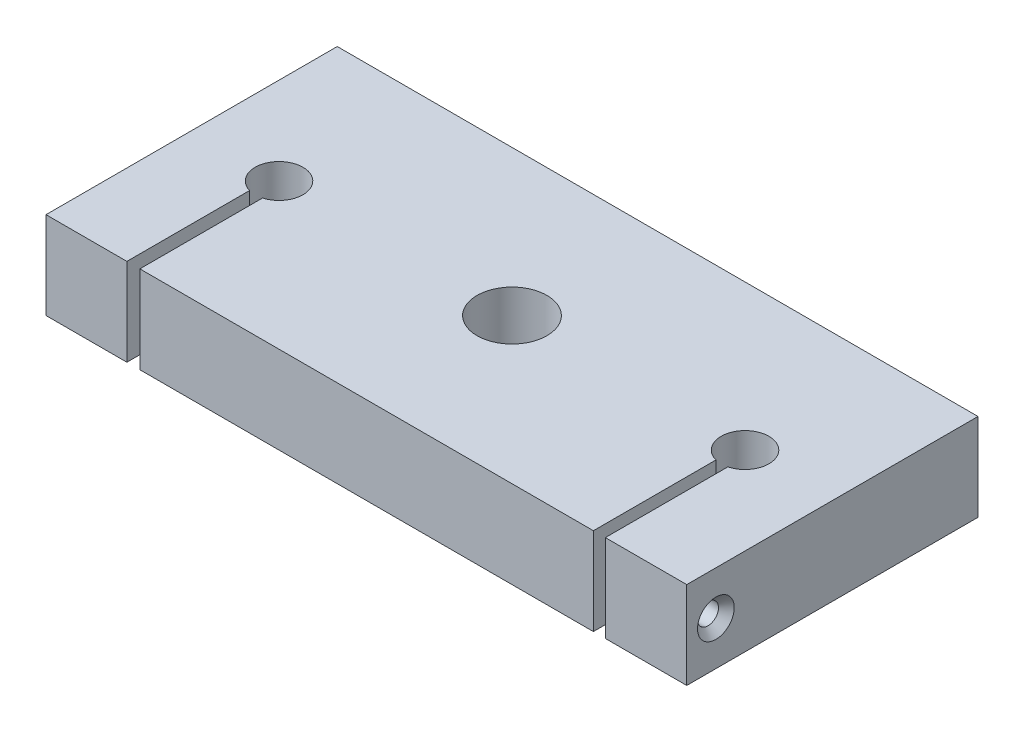
ISO-10303-21;
HEADER;
FILE_DESCRIPTION(('STEP AP214'),'2;1');
FILE_NAME('part.step','',(''),(''),'','','');
FILE_SCHEMA(('AUTOMOTIVE_DESIGN { 1 0 10303 214 1 1 1 1 }'));
ENDSEC;
DATA;
#1=APPLICATION_CONTEXT('core data for automotive mechanical design processes');
#2=APPLICATION_PROTOCOL_DEFINITION('international standard','automotive_design',2000,#1);
#3=PRODUCT_CONTEXT('',#1,'mechanical');
#4=PRODUCT('Part','Part','',(#3));
#5=PRODUCT_RELATED_PRODUCT_CATEGORY('part','',(#4));
#6=PRODUCT_DEFINITION_FORMATION('','',#4);
#7=PRODUCT_DEFINITION_CONTEXT('part definition',#1,'design');
#8=PRODUCT_DEFINITION('design','',#6,#7);
#9=PRODUCT_DEFINITION_SHAPE('','',#8);
#10=(LENGTH_UNIT() NAMED_UNIT(*) SI_UNIT(.MILLI.,.METRE.));
#11=(NAMED_UNIT(*) PLANE_ANGLE_UNIT() SI_UNIT($,.RADIAN.));
#12=(NAMED_UNIT(*) SI_UNIT($,.STERADIAN.) SOLID_ANGLE_UNIT());
#13=UNCERTAINTY_MEASURE_WITH_UNIT(LENGTH_MEASURE(1.E-05),#10,'distance_accuracy_value','');
#14=(GEOMETRIC_REPRESENTATION_CONTEXT(3) GLOBAL_UNCERTAINTY_ASSIGNED_CONTEXT((#13)) GLOBAL_UNIT_ASSIGNED_CONTEXT((#10,
#11,#12)) REPRESENTATION_CONTEXT('',''));
#15=CARTESIAN_POINT('',(0.,0.,0.));
#16=DIRECTION('',(0.,0.,1.));
#17=DIRECTION('',(1.,0.,0.));
#18=AXIS2_PLACEMENT_3D('',#15,#16,#17);
#19=CARTESIAN_POINT('',(55.,15.,25.));
#20=DIRECTION('',(0.,0.,-1.));
#21=DIRECTION('',(-1.,0.,0.));
#22=AXIS2_PLACEMENT_3D('',#19,#20,#21);
#23=PLANE('',#22);
#24=DIRECTION('',(1.,0.,0.));
#25=VECTOR('',#24,1.);
#26=CARTESIAN_POINT('',(55.,15.,25.));
#27=LINE('',#26,#25);
#28=CARTESIAN_POINT('',(41.0249999999999,15.,25.));
#29=VERTEX_POINT('',#28);
#30=CARTESIAN_POINT('',(55.,15.,25.));
#31=VERTEX_POINT('',#30);
#32=EDGE_CURVE('E186',#29,#31,#27,.T.);
#33=ORIENTED_EDGE('',*,*,#32,.F.);
#34=DIRECTION('',(0.,-1.,0.));
#35=VECTOR('',#34,1.);
#36=CARTESIAN_POINT('',(41.0249999999999,15.,25.));
#37=LINE('',#36,#35);
#38=CARTESIAN_POINT('',(41.0249999999999,0.,25.));
#39=VERTEX_POINT('',#38);
#40=EDGE_CURVE('E224',#29,#39,#37,.T.);
#41=ORIENTED_EDGE('',*,*,#40,.T.);
#42=DIRECTION('',(1.,0.,0.));
#43=VECTOR('',#42,1.);
#44=CARTESIAN_POINT('',(55.,0.,25.));
#45=LINE('',#44,#43);
#46=CARTESIAN_POINT('',(55.,0.,25.));
#47=VERTEX_POINT('',#46);
#48=EDGE_CURVE('E198',#39,#47,#45,.T.);
#49=ORIENTED_EDGE('',*,*,#48,.T.);
#50=DIRECTION('',(0.,-1.,0.));
#51=VECTOR('',#50,1.);
#52=CARTESIAN_POINT('',(55.,15.,25.));
#53=LINE('',#52,#51);
#54=EDGE_CURVE('E211',#31,#47,#53,.T.);
#55=ORIENTED_EDGE('',*,*,#54,.F.);
#56=EDGE_LOOP('',(#33,#41,#49,#55));
#57=FACE_BOUND('',#56,.T.);
#58=ADVANCED_FACE('F39',(#57),#23,.F.);
#59=CARTESIAN_POINT('',(-38.8860320239023,0.,25.));
#60=VERTEX_POINT('',#59);
#61=CARTESIAN_POINT('',(38.9749999999999,0.,25.));
#62=VERTEX_POINT('',#61);
#63=EDGE_CURVE('E203',#60,#62,#45,.T.);
#64=ORIENTED_EDGE('',*,*,#63,.T.);
#65=DIRECTION('',(0.,1.,0.));
#66=VECTOR('',#65,1.);
#67=CARTESIAN_POINT('',(38.9749999999999,15.,25.));
#68=LINE('',#67,#66);
#69=CARTESIAN_POINT('',(38.975,15.,25.));
#70=VERTEX_POINT('',#69);
#71=EDGE_CURVE('E222',#62,#70,#68,.T.);
#72=ORIENTED_EDGE('',*,*,#71,.T.);
#73=CARTESIAN_POINT('',(-38.8860320239023,15.,25.));
#74=VERTEX_POINT('',#73);
#75=EDGE_CURVE('E149',#74,#70,#27,.T.);
#76=ORIENTED_EDGE('',*,*,#75,.F.);
#77=DIRECTION('',(0.,-1.,0.));
#78=VECTOR('',#77,1.);
#79=CARTESIAN_POINT('',(-38.8860320239023,15.,25.));
#80=LINE('',#79,#78);
#81=EDGE_CURVE('E219',#74,#60,#80,.T.);
#82=ORIENTED_EDGE('',*,*,#81,.T.);
#83=EDGE_LOOP('',(#64,#72,#76,#82));
#84=FACE_BOUND('',#83,.T.);
#85=ADVANCED_FACE('F258',(#84),#23,.F.);
#86=CARTESIAN_POINT('',(0.,15.,0.));
#87=DIRECTION('',(0.,1.,0.));
#88=DIRECTION('',(0.,0.,1.));
#89=AXIS2_PLACEMENT_3D('',#86,#87,#88);
#90=PLANE('',#89);
#91=DIRECTION('',(0.,0.,-1.));
#92=VECTOR('',#91,1.);
#93=CARTESIAN_POINT('',(41.0249999999999,15.,3.96289404806572));
#94=LINE('',#93,#92);
#95=CARTESIAN_POINT('',(41.0249999999999,15.,3.96289404806572));
#96=VERTEX_POINT('',#95);
#97=EDGE_CURVE('E133',#29,#96,#94,.T.);
#98=ORIENTED_EDGE('',*,*,#97,.F.);
#99=ORIENTED_EDGE('',*,*,#32,.T.);
#100=DIRECTION('',(0.,0.,-1.));
#101=VECTOR('',#100,1.);
#102=CARTESIAN_POINT('',(55.,15.,25.));
#103=LINE('',#102,#101);
#104=CARTESIAN_POINT('',(55.,15.,-25.));
#105=VERTEX_POINT('',#104);
#106=EDGE_CURVE('E191',#31,#105,#103,.T.);
#107=ORIENTED_EDGE('',*,*,#106,.T.);
#108=DIRECTION('',(-1.,0.,0.));
#109=VECTOR('',#108,1.);
#110=CARTESIAN_POINT('',(55.,15.,-25.));
#111=LINE('',#110,#109);
#112=CARTESIAN_POINT('',(-55.,15.,-25.));
#113=VERTEX_POINT('',#112);
#114=EDGE_CURVE('E193',#105,#113,#111,.T.);
#115=ORIENTED_EDGE('',*,*,#114,.T.);
#116=DIRECTION('',(0.,0.,1.));
#117=VECTOR('',#116,1.);
#118=CARTESIAN_POINT('',(-55.,15.,25.));
#119=LINE('',#118,#117);
#120=CARTESIAN_POINT('',(-55.,15.,25.));
#121=VERTEX_POINT('',#120);
#122=EDGE_CURVE('E183',#113,#121,#119,.T.);
#123=ORIENTED_EDGE('',*,*,#122,.T.);
#124=CARTESIAN_POINT('',(-41.1139679760979,15.,25.));
#125=VERTEX_POINT('',#124);
#126=EDGE_CURVE('E188',#121,#125,#27,.T.);
#127=ORIENTED_EDGE('',*,*,#126,.T.);
#128=DIRECTION('',(0.,0.,1.));
#129=VECTOR('',#128,1.);
#130=CARTESIAN_POINT('',(-41.1139679760979,15.,3.93885288123265));
#131=LINE('',#130,#129);
#132=CARTESIAN_POINT('',(-41.1139679760979,15.,3.93885288123265));
#133=VERTEX_POINT('',#132);
#134=EDGE_CURVE('E62',#133,#125,#131,.T.);
#135=ORIENTED_EDGE('',*,*,#134,.F.);
#136=CARTESIAN_POINT('',(-40.0000000000001,15.,-0.00691388179688279));
#137=DIRECTION('',(0.,1.,0.));
#138=DIRECTION('',(0.,0.,1.));
#139=AXIS2_PLACEMENT_3D('',#136,#137,#138);
#140=CIRCLE('',#139,4.1);
#141=CARTESIAN_POINT('',(-38.8860320239023,15.,3.93885288123265));
#142=VERTEX_POINT('',#141);
#143=EDGE_CURVE('E156',#142,#133,#140,.T.);
#144=ORIENTED_EDGE('',*,*,#143,.F.);
#145=DIRECTION('',(0.,0.,-1.));
#146=VECTOR('',#145,1.);
#147=CARTESIAN_POINT('',(-38.8860320239023,15.,3.93885288123265));
#148=LINE('',#147,#146);
#149=EDGE_CURVE('E161',#74,#142,#148,.T.);
#150=ORIENTED_EDGE('',*,*,#149,.F.);
#151=ORIENTED_EDGE('',*,*,#75,.T.);
#152=DIRECTION('',(0.,0.,1.));
#153=VECTOR('',#152,1.);
#154=CARTESIAN_POINT('',(38.975,15.,3.96289404806572));
#155=LINE('',#154,#153);
#156=CARTESIAN_POINT('',(38.975,15.,3.96289404806572));
#157=VERTEX_POINT('',#156);
#158=EDGE_CURVE('E54',#157,#70,#155,.T.);
#159=ORIENTED_EDGE('',*,*,#158,.F.);
#160=CARTESIAN_POINT('',(40.,15.,-0.00691388179688279));
#161=DIRECTION('',(0.,1.,0.));
#162=DIRECTION('',(0.,0.,1.));
#163=AXIS2_PLACEMENT_3D('',#160,#161,#162);
#164=CIRCLE('',#163,4.1);
#165=EDGE_CURVE('E136',#96,#157,#164,.T.);
#166=ORIENTED_EDGE('',*,*,#165,.F.);
#167=EDGE_LOOP('',(#98,#99,#107,#115,#123,#127,#135,#144,#150,#151,#159,#166));
#168=FACE_BOUND('',#167,.T.);
#169=CARTESIAN_POINT('',(0.,15.,0.));
#170=DIRECTION('',(0.,1.,0.));
#171=DIRECTION('',(0.,0.,1.));
#172=AXIS2_PLACEMENT_3D('',#169,#170,#171);
#173=CIRCLE('',#172,6.);
#174=CARTESIAN_POINT('',(0.,15.,6.));
#175=VERTEX_POINT('',#174);
#176=EDGE_CURVE('E177',#175,#175,#173,.T.);
#177=ORIENTED_EDGE('',*,*,#176,.F.);
#178=EDGE_LOOP('',(#177));
#179=FACE_BOUND('',#178,.T.);
#180=ADVANCED_FACE('F145',(#168,#179),#90,.T.);
#181=CARTESIAN_POINT('',(0.,0.,0.));
#182=DIRECTION('',(0.,1.,0.));
#183=DIRECTION('',(0.,0.,1.));
#184=AXIS2_PLACEMENT_3D('',#181,#182,#183);
#185=PLANE('',#184);
#186=ORIENTED_EDGE('',*,*,#48,.F.);
#187=DIRECTION('',(0.,0.,-1.));
#188=VECTOR('',#187,1.);
#189=CARTESIAN_POINT('',(41.0249999999999,0.,0.));
#190=LINE('',#189,#188);
#191=CARTESIAN_POINT('',(41.0249999999999,0.,3.96289404806572));
#192=VERTEX_POINT('',#191);
#193=EDGE_CURVE('E173',#39,#192,#190,.T.);
#194=ORIENTED_EDGE('',*,*,#193,.T.);
#195=CARTESIAN_POINT('',(40.,0.,-0.00691388179688279));
#196=DIRECTION('',(0.,1.,0.));
#197=DIRECTION('',(0.,0.,1.));
#198=AXIS2_PLACEMENT_3D('',#195,#196,#197);
#199=CIRCLE('',#198,4.1);
#200=CARTESIAN_POINT('',(38.975,0.,3.96289404806572));
#201=VERTEX_POINT('',#200);
#202=EDGE_CURVE('E11',#192,#201,#199,.T.);
#203=ORIENTED_EDGE('',*,*,#202,.T.);
#204=DIRECTION('',(0.,0.,1.));
#205=VECTOR('',#204,1.);
#206=CARTESIAN_POINT('',(38.975,0.,0.));
#207=LINE('',#206,#205);
#208=EDGE_CURVE('E130',#201,#62,#207,.T.);
#209=ORIENTED_EDGE('',*,*,#208,.T.);
#210=ORIENTED_EDGE('',*,*,#63,.F.);
#211=DIRECTION('',(0.,0.,-1.));
#212=VECTOR('',#211,1.);
#213=CARTESIAN_POINT('',(-38.8860320239023,0.,0.));
#214=LINE('',#213,#212);
#215=CARTESIAN_POINT('',(-38.8860320239023,0.,3.93885288123265));
#216=VERTEX_POINT('',#215);
#217=EDGE_CURVE('E169',#60,#216,#214,.T.);
#218=ORIENTED_EDGE('',*,*,#217,.T.);
#219=CARTESIAN_POINT('',(-40.0000000000001,0.,-0.00691388179688279));
#220=DIRECTION('',(0.,1.,0.));
#221=DIRECTION('',(0.,0.,1.));
#222=AXIS2_PLACEMENT_3D('',#219,#220,#221);
#223=CIRCLE('',#222,4.1);
#224=CARTESIAN_POINT('',(-41.1139679760979,0.,3.93885288123265));
#225=VERTEX_POINT('',#224);
#226=EDGE_CURVE('E47',#216,#225,#223,.T.);
#227=ORIENTED_EDGE('',*,*,#226,.T.);
#228=DIRECTION('',(0.,0.,1.));
#229=VECTOR('',#228,1.);
#230=CARTESIAN_POINT('',(-41.1139679760979,0.,0.));
#231=LINE('',#230,#229);
#232=CARTESIAN_POINT('',(-41.1139679760979,0.,25.));
#233=VERTEX_POINT('',#232);
#234=EDGE_CURVE('E154',#225,#233,#231,.T.);
#235=ORIENTED_EDGE('',*,*,#234,.T.);
#236=CARTESIAN_POINT('',(-55.,0.,25.));
#237=VERTEX_POINT('',#236);
#238=EDGE_CURVE('E199',#237,#233,#45,.T.);
#239=ORIENTED_EDGE('',*,*,#238,.F.);
#240=DIRECTION('',(0.,0.,1.));
#241=VECTOR('',#240,1.);
#242=CARTESIAN_POINT('',(-55.,0.,25.));
#243=LINE('',#242,#241);
#244=CARTESIAN_POINT('',(-55.,0.,-25.));
#245=VERTEX_POINT('',#244);
#246=EDGE_CURVE('E180',#245,#237,#243,.T.);
#247=ORIENTED_EDGE('',*,*,#246,.F.);
#248=DIRECTION('',(-1.,0.,0.));
#249=VECTOR('',#248,1.);
#250=CARTESIAN_POINT('',(55.,0.,-25.));
#251=LINE('',#250,#249);
#252=CARTESIAN_POINT('',(55.,0.,-25.));
#253=VERTEX_POINT('',#252);
#254=EDGE_CURVE('E187',#253,#245,#251,.T.);
#255=ORIENTED_EDGE('',*,*,#254,.F.);
#256=DIRECTION('',(0.,0.,-1.));
#257=VECTOR('',#256,1.);
#258=CARTESIAN_POINT('',(55.,0.,25.));
#259=LINE('',#258,#257);
#260=EDGE_CURVE('E202',#47,#253,#259,.T.);
#261=ORIENTED_EDGE('',*,*,#260,.F.);
#262=EDGE_LOOP('',(#186,#194,#203,#209,#210,#218,#227,#235,#239,#247,#255,#261));
#263=FACE_BOUND('',#262,.T.);
#264=CARTESIAN_POINT('',(0.,0.,0.));
#265=DIRECTION('',(0.,1.,0.));
#266=DIRECTION('',(0.,0.,1.));
#267=AXIS2_PLACEMENT_3D('',#264,#265,#266);
#268=CIRCLE('',#267,6.);
#269=CARTESIAN_POINT('',(0.,0.,6.));
#270=VERTEX_POINT('',#269);
#271=EDGE_CURVE('E176',#270,#270,#268,.T.);
#272=ORIENTED_EDGE('',*,*,#271,.T.);
#273=EDGE_LOOP('',(#272));
#274=FACE_BOUND('',#273,.T.);
#275=ADVANCED_FACE('F229',(#263,#274),#185,.F.);
#276=CARTESIAN_POINT('',(-55.,15.,25.));
#277=DIRECTION('',(1.,0.,0.));
#278=DIRECTION('',(0.,0.,-1.));
#279=AXIS2_PLACEMENT_3D('',#276,#277,#278);
#280=PLANE('',#279);
#281=CARTESIAN_POINT('',(-55.,7.5,20.));
#282=DIRECTION('',(-1.,0.,0.));
#283=DIRECTION('',(0.,0.,1.));
#284=AXIS2_PLACEMENT_3D('',#281,#282,#283);
#285=CIRCLE('',#284,3.15);
#286=CARTESIAN_POINT('',(-55.,7.5,23.15));
#287=VERTEX_POINT('',#286);
#288=EDGE_CURVE('E285',#287,#287,#285,.T.);
#289=ORIENTED_EDGE('',*,*,#288,.F.);
#290=EDGE_LOOP('',(#289));
#291=FACE_BOUND('',#290,.T.);
#292=ORIENTED_EDGE('',*,*,#246,.T.);
#293=DIRECTION('',(0.,-1.,0.));
#294=VECTOR('',#293,1.);
#295=CARTESIAN_POINT('',(-55.,15.,25.));
#296=LINE('',#295,#294);
#297=EDGE_CURVE('E214',#121,#237,#296,.T.);
#298=ORIENTED_EDGE('',*,*,#297,.F.);
#299=ORIENTED_EDGE('',*,*,#122,.F.);
#300=DIRECTION('',(0.,-1.,0.));
#301=VECTOR('',#300,1.);
#302=CARTESIAN_POINT('',(-55.,15.,-25.));
#303=LINE('',#302,#301);
#304=EDGE_CURVE('E195',#113,#245,#303,.T.);
#305=ORIENTED_EDGE('',*,*,#304,.T.);
#306=EDGE_LOOP('',(#292,#298,#299,#305));
#307=FACE_BOUND('',#306,.T.);
#308=ADVANCED_FACE('F41',(#291,#307),#280,.F.);
#309=ORIENTED_EDGE('',*,*,#238,.T.);
#310=DIRECTION('',(0.,1.,0.));
#311=VECTOR('',#310,1.);
#312=CARTESIAN_POINT('',(-41.1139679760979,15.,25.));
#313=LINE('',#312,#311);
#314=EDGE_CURVE('E217',#233,#125,#313,.T.);
#315=ORIENTED_EDGE('',*,*,#314,.T.);
#316=ORIENTED_EDGE('',*,*,#126,.F.);
#317=ORIENTED_EDGE('',*,*,#297,.T.);
#318=EDGE_LOOP('',(#309,#315,#316,#317));
#319=FACE_BOUND('',#318,.T.);
#320=ADVANCED_FACE('F242',(#319),#23,.F.);
#321=CARTESIAN_POINT('',(55.,15.,25.));
#322=DIRECTION('',(-1.,0.,0.));
#323=DIRECTION('',(0.,0.,1.));
#324=AXIS2_PLACEMENT_3D('',#321,#322,#323);
#325=PLANE('',#324);
#326=CARTESIAN_POINT('',(55.,7.5,20.));
#327=DIRECTION('',(1.,0.,0.));
#328=DIRECTION('',(0.,0.,-1.));
#329=AXIS2_PLACEMENT_3D('',#326,#327,#328);
#330=CIRCLE('',#329,3.15);
#331=CARTESIAN_POINT('',(55.,7.5,16.85));
#332=VERTEX_POINT('',#331);
#333=EDGE_CURVE('E336',#332,#332,#330,.T.);
#334=ORIENTED_EDGE('',*,*,#333,.F.);
#335=EDGE_LOOP('',(#334));
#336=FACE_BOUND('',#335,.T.);
#337=ORIENTED_EDGE('',*,*,#260,.T.);
#338=DIRECTION('',(0.,-1.,0.));
#339=VECTOR('',#338,1.);
#340=CARTESIAN_POINT('',(55.,15.,-25.));
#341=LINE('',#340,#339);
#342=EDGE_CURVE('E208',#105,#253,#341,.T.);
#343=ORIENTED_EDGE('',*,*,#342,.F.);
#344=ORIENTED_EDGE('',*,*,#106,.F.);
#345=ORIENTED_EDGE('',*,*,#54,.T.);
#346=EDGE_LOOP('',(#337,#343,#344,#345));
#347=FACE_BOUND('',#346,.T.);
#348=ADVANCED_FACE('F268',(#336,#347),#325,.F.);
#349=CARTESIAN_POINT('',(55.,15.,-25.));
#350=DIRECTION('',(0.,0.,1.));
#351=DIRECTION('',(1.,0.,0.));
#352=AXIS2_PLACEMENT_3D('',#349,#350,#351);
#353=PLANE('',#352);
#354=ORIENTED_EDGE('',*,*,#254,.T.);
#355=ORIENTED_EDGE('',*,*,#304,.F.);
#356=ORIENTED_EDGE('',*,*,#114,.F.);
#357=ORIENTED_EDGE('',*,*,#342,.T.);
#358=EDGE_LOOP('',(#354,#355,#356,#357));
#359=FACE_BOUND('',#358,.T.);
#360=ADVANCED_FACE('F274',(#359),#353,.F.);
#361=CARTESIAN_POINT('',(0.,15.,0.));
#362=DIRECTION('',(0.,-1.,0.));
#363=DIRECTION('',(0.,0.,-1.));
#364=AXIS2_PLACEMENT_3D('',#361,#362,#363);
#365=CYLINDRICAL_SURFACE('',#364,6.);
#366=ORIENTED_EDGE('',*,*,#176,.T.);
#367=EDGE_LOOP('',(#366));
#368=FACE_BOUND('',#367,.T.);
#369=ORIENTED_EDGE('',*,*,#271,.F.);
#370=EDGE_LOOP('',(#369));
#371=FACE_BOUND('',#370,.T.);
#372=ADVANCED_FACE('F394',(#368,#371),#365,.F.);
#373=CARTESIAN_POINT('',(-40.0000000000001,-9.00000000000001,-0.00691388179688279));
#374=DIRECTION('',(0.,1.,0.));
#375=DIRECTION('',(0.,0.,1.));
#376=AXIS2_PLACEMENT_3D('',#373,#374,#375);
#377=CYLINDRICAL_SURFACE('',#376,4.1);
#378=DIRECTION('',(0.,1.,0.));
#379=VECTOR('',#378,1.);
#380=CARTESIAN_POINT('',(-38.8860320239023,-9.00000000000001,3.93885288123265));
#381=LINE('',#380,#379);
#382=EDGE_CURVE('E142',#216,#142,#381,.T.);
#383=ORIENTED_EDGE('',*,*,#382,.T.);
#384=ORIENTED_EDGE('',*,*,#143,.T.);
#385=DIRECTION('',(0.,1.,0.));
#386=VECTOR('',#385,1.);
#387=CARTESIAN_POINT('',(-41.1139679760979,-9.00000000000001,3.93885288123265));
#388=LINE('',#387,#386);
#389=EDGE_CURVE('E164',#225,#133,#388,.T.);
#390=ORIENTED_EDGE('',*,*,#389,.F.);
#391=ORIENTED_EDGE('',*,*,#226,.F.);
#392=EDGE_LOOP('',(#383,#384,#390,#391));
#393=FACE_BOUND('',#392,.T.);
#394=ADVANCED_FACE('F235',(#393),#377,.F.);
#395=CARTESIAN_POINT('',(-38.8860320239023,-9.00000000000001,3.93885288123265));
#396=DIRECTION('',(1.,0.,0.));
#397=DIRECTION('',(0.,0.,-1.));
#398=AXIS2_PLACEMENT_3D('',#395,#396,#397);
#399=PLANE('',#398);
#400=CARTESIAN_POINT('',(-38.8860320239023,7.5,20.));
#401=DIRECTION('',(-1.,0.,0.));
#402=DIRECTION('',(0.,0.,1.));
#403=AXIS2_PLACEMENT_3D('',#400,#401,#402);
#404=CIRCLE('',#403,1.24999999999999);
#405=CARTESIAN_POINT('',(-38.8860320239023,7.5,21.25));
#406=VERTEX_POINT('',#405);
#407=EDGE_CURVE('E332',#406,#406,#404,.T.);
#408=ORIENTED_EDGE('',*,*,#407,.F.);
#409=EDGE_LOOP('',(#408));
#410=FACE_BOUND('',#409,.T.);
#411=ORIENTED_EDGE('',*,*,#81,.F.);
#412=ORIENTED_EDGE('',*,*,#149,.T.);
#413=ORIENTED_EDGE('',*,*,#382,.F.);
#414=ORIENTED_EDGE('',*,*,#217,.F.);
#415=EDGE_LOOP('',(#411,#412,#413,#414));
#416=FACE_BOUND('',#415,.T.);
#417=ADVANCED_FACE('F237',(#410,#416),#399,.F.);
#418=CARTESIAN_POINT('',(-41.1139679760979,-9.00000000000001,3.93885288123265));
#419=DIRECTION('',(-1.,0.,0.));
#420=DIRECTION('',(0.,0.,1.));
#421=AXIS2_PLACEMENT_3D('',#418,#419,#420);
#422=PLANE('',#421);
#423=CARTESIAN_POINT('',(-41.1139679760979,7.5,20.));
#424=DIRECTION('',(-1.,0.,0.));
#425=DIRECTION('',(0.,0.,1.));
#426=AXIS2_PLACEMENT_3D('',#423,#424,#425);
#427=CIRCLE('',#426,1.8);
#428=CARTESIAN_POINT('',(-41.1139679760979,7.5,21.8));
#429=VERTEX_POINT('',#428);
#430=EDGE_CURVE('E159',#429,#429,#427,.F.);
#431=ORIENTED_EDGE('',*,*,#430,.F.);
#432=EDGE_LOOP('',(#431));
#433=FACE_BOUND('',#432,.T.);
#434=ORIENTED_EDGE('',*,*,#389,.T.);
#435=ORIENTED_EDGE('',*,*,#134,.T.);
#436=ORIENTED_EDGE('',*,*,#314,.F.);
#437=ORIENTED_EDGE('',*,*,#234,.F.);
#438=EDGE_LOOP('',(#434,#435,#436,#437));
#439=FACE_BOUND('',#438,.T.);
#440=ADVANCED_FACE('F243',(#433,#439),#422,.F.);
#441=CARTESIAN_POINT('',(40.,-9.00000000000001,-0.00691388179688279));
#442=DIRECTION('',(0.,1.,0.));
#443=DIRECTION('',(0.,0.,1.));
#444=AXIS2_PLACEMENT_3D('',#441,#442,#443);
#445=CYLINDRICAL_SURFACE('',#444,4.1);
#446=DIRECTION('',(0.,1.,0.));
#447=VECTOR('',#446,1.);
#448=CARTESIAN_POINT('',(41.0249999999999,-9.00000000000001,3.96289404806572));
#449=LINE('',#448,#447);
#450=EDGE_CURVE('E132',#192,#96,#449,.T.);
#451=ORIENTED_EDGE('',*,*,#450,.T.);
#452=ORIENTED_EDGE('',*,*,#165,.T.);
#453=DIRECTION('',(0.,1.,0.));
#454=VECTOR('',#453,1.);
#455=CARTESIAN_POINT('',(38.975,-9.00000000000001,3.96289404806572));
#456=LINE('',#455,#454);
#457=EDGE_CURVE('E126',#201,#157,#456,.T.);
#458=ORIENTED_EDGE('',*,*,#457,.F.);
#459=ORIENTED_EDGE('',*,*,#202,.F.);
#460=EDGE_LOOP('',(#451,#452,#458,#459));
#461=FACE_BOUND('',#460,.T.);
#462=ADVANCED_FACE('F137',(#461),#445,.F.);
#463=CARTESIAN_POINT('',(41.0249999999999,-9.00000000000001,3.96289404806572));
#464=DIRECTION('',(1.,0.,0.));
#465=DIRECTION('',(0.,0.,-1.));
#466=AXIS2_PLACEMENT_3D('',#463,#464,#465);
#467=PLANE('',#466);
#468=CARTESIAN_POINT('',(41.0249999999999,7.5,20.));
#469=DIRECTION('',(1.,0.,0.));
#470=DIRECTION('',(0.,0.,-1.));
#471=AXIS2_PLACEMENT_3D('',#468,#469,#470);
#472=CIRCLE('',#471,1.79999999999999);
#473=CARTESIAN_POINT('',(41.0249999999999,7.5,18.2));
#474=VERTEX_POINT('',#473);
#475=EDGE_CURVE('E343',#474,#474,#472,.F.);
#476=ORIENTED_EDGE('',*,*,#475,.F.);
#477=EDGE_LOOP('',(#476));
#478=FACE_BOUND('',#477,.T.);
#479=ORIENTED_EDGE('',*,*,#40,.F.);
#480=ORIENTED_EDGE('',*,*,#97,.T.);
#481=ORIENTED_EDGE('',*,*,#450,.F.);
#482=ORIENTED_EDGE('',*,*,#193,.F.);
#483=EDGE_LOOP('',(#479,#480,#481,#482));
#484=FACE_BOUND('',#483,.T.);
#485=ADVANCED_FACE('F251',(#478,#484),#467,.F.);
#486=CARTESIAN_POINT('',(38.975,-9.00000000000001,3.96289404806572));
#487=DIRECTION('',(-1.,0.,0.));
#488=DIRECTION('',(0.,0.,1.));
#489=AXIS2_PLACEMENT_3D('',#486,#487,#488);
#490=PLANE('',#489);
#491=CARTESIAN_POINT('',(38.9749999999999,7.5,20.));
#492=DIRECTION('',(-1.,0.,0.));
#493=DIRECTION('',(0.,0.,1.));
#494=AXIS2_PLACEMENT_3D('',#491,#492,#493);
#495=CIRCLE('',#494,1.24999999999998);
#496=CARTESIAN_POINT('',(38.9749999999999,7.5,21.25));
#497=VERTEX_POINT('',#496);
#498=EDGE_CURVE('E335',#497,#497,#495,.T.);
#499=ORIENTED_EDGE('',*,*,#498,.T.);
#500=EDGE_LOOP('',(#499));
#501=FACE_BOUND('',#500,.T.);
#502=ORIENTED_EDGE('',*,*,#457,.T.);
#503=ORIENTED_EDGE('',*,*,#158,.T.);
#504=ORIENTED_EDGE('',*,*,#71,.F.);
#505=ORIENTED_EDGE('',*,*,#208,.F.);
#506=EDGE_LOOP('',(#502,#503,#504,#505));
#507=FACE_BOUND('',#506,.T.);
#508=ADVANCED_FACE('F128',(#501,#507),#490,.F.);
#509=CARTESIAN_POINT('',(-55.,7.5,20.));
#510=DIRECTION('',(-1.,0.,0.));
#511=DIRECTION('',(0.,0.,1.));
#512=AXIS2_PLACEMENT_3D('',#509,#510,#511);
#513=CYLINDRICAL_SURFACE('',#512,1.8);
#514=ORIENTED_EDGE('',*,*,#430,.T.);
#515=EDGE_LOOP('',(#514));
#516=FACE_BOUND('',#515,.T.);
#517=CARTESIAN_POINT('',(-53.65,7.5,20.));
#518=DIRECTION('',(-1.,0.,0.));
#519=DIRECTION('',(0.,0.,1.));
#520=AXIS2_PLACEMENT_3D('',#517,#518,#519);
#521=CIRCLE('',#520,1.8);
#522=CARTESIAN_POINT('',(-53.65,7.5,21.8));
#523=VERTEX_POINT('',#522);
#524=EDGE_CURVE('E350',#523,#523,#521,.T.);
#525=ORIENTED_EDGE('',*,*,#524,.T.);
#526=EDGE_LOOP('',(#525));
#527=FACE_BOUND('',#526,.T.);
#528=ADVANCED_FACE('F304',(#516,#527),#513,.F.);
#529=CARTESIAN_POINT('',(-55.,7.5,20.));
#530=DIRECTION('',(-1.,0.,0.));
#531=DIRECTION('',(0.,0.,1.));
#532=AXIS2_PLACEMENT_3D('',#529,#530,#531);
#533=CONICAL_SURFACE('',#532,3.15,0.785398163397448);
#534=ORIENTED_EDGE('',*,*,#524,.F.);
#535=EDGE_LOOP('',(#534));
#536=FACE_BOUND('',#535,.T.);
#537=ORIENTED_EDGE('',*,*,#288,.T.);
#538=EDGE_LOOP('',(#537));
#539=FACE_BOUND('',#538,.T.);
#540=ADVANCED_FACE('F311',(#536,#539),#533,.F.);
#541=CARTESIAN_POINT('',(55.,7.5,20.));
#542=DIRECTION('',(1.,0.,0.));
#543=DIRECTION('',(0.,0.,-1.));
#544=AXIS2_PLACEMENT_3D('',#541,#542,#543);
#545=CYLINDRICAL_SURFACE('',#544,1.79999999999999);
#546=ORIENTED_EDGE('',*,*,#475,.T.);
#547=EDGE_LOOP('',(#546));
#548=FACE_BOUND('',#547,.T.);
#549=CARTESIAN_POINT('',(53.65,7.5,20.));
#550=DIRECTION('',(1.,0.,0.));
#551=DIRECTION('',(0.,0.,-1.));
#552=AXIS2_PLACEMENT_3D('',#549,#550,#551);
#553=CIRCLE('',#552,1.79999999999999);
#554=CARTESIAN_POINT('',(53.65,7.5,18.2));
#555=VERTEX_POINT('',#554);
#556=EDGE_CURVE('E339',#555,#555,#553,.T.);
#557=ORIENTED_EDGE('',*,*,#556,.T.);
#558=EDGE_LOOP('',(#557));
#559=FACE_BOUND('',#558,.T.);
#560=ADVANCED_FACE('F315',(#548,#559),#545,.F.);
#561=CARTESIAN_POINT('',(55.,7.5,20.));
#562=DIRECTION('',(1.,0.,0.));
#563=DIRECTION('',(0.,0.,-1.));
#564=AXIS2_PLACEMENT_3D('',#561,#562,#563);
#565=CONICAL_SURFACE('',#564,3.15,0.785398163397451);
#566=ORIENTED_EDGE('',*,*,#556,.F.);
#567=EDGE_LOOP('',(#566));
#568=FACE_BOUND('',#567,.T.);
#569=ORIENTED_EDGE('',*,*,#333,.T.);
#570=EDGE_LOOP('',(#569));
#571=FACE_BOUND('',#570,.T.);
#572=ADVANCED_FACE('F319',(#568,#571),#565,.F.);
#573=CARTESIAN_POINT('',(-38.8860320239023,7.5,20.));
#574=DIRECTION('',(-1.,0.,0.));
#575=DIRECTION('',(0.,0.,1.));
#576=AXIS2_PLACEMENT_3D('',#573,#574,#575);
#577=CYLINDRICAL_SURFACE('',#576,1.24999999999998);
#578=ORIENTED_EDGE('',*,*,#407,.T.);
#579=EDGE_LOOP('',(#578));
#580=FACE_BOUND('',#579,.T.);
#581=ORIENTED_EDGE('',*,*,#498,.F.);
#582=EDGE_LOOP('',(#581));
#583=FACE_BOUND('',#582,.T.);
#584=ADVANCED_FACE('F323',(#580,#583),#577,.F.);
#585=CLOSED_SHELL('',(#58,#85,#180,#275,#308,#320,#348,#360,#372,#394,#417,#440,#462,#485,#508,
#528,#540,#560,#572,#584));
#586=MANIFOLD_SOLID_BREP('B2',#585);
#587=ADVANCED_BREP_SHAPE_REPRESENTATION('',(#18,#586),#14);
#588=SHAPE_DEFINITION_REPRESENTATION(#9,#587);
ENDSEC;
END-ISO-10303-21;
